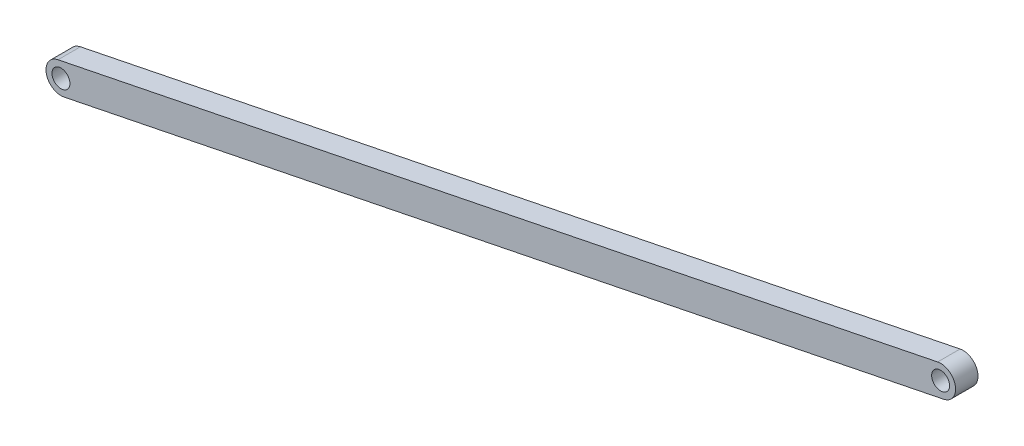
ISO-10303-21;
HEADER;
FILE_DESCRIPTION(('STEP AP214'),'2;1');
FILE_NAME('part.step','',(''),(''),'','','');
FILE_SCHEMA(('AUTOMOTIVE_DESIGN { 1 0 10303 214 1 1 1 1 }'));
ENDSEC;
DATA;
#1=APPLICATION_CONTEXT('core data for automotive mechanical design processes');
#2=APPLICATION_PROTOCOL_DEFINITION('international standard','automotive_design',2000,#1);
#3=PRODUCT_CONTEXT('',#1,'mechanical');
#4=PRODUCT('Part','Part','',(#3));
#5=PRODUCT_RELATED_PRODUCT_CATEGORY('part','',(#4));
#6=PRODUCT_DEFINITION_FORMATION('','',#4);
#7=PRODUCT_DEFINITION_CONTEXT('part definition',#1,'design');
#8=PRODUCT_DEFINITION('design','',#6,#7);
#9=PRODUCT_DEFINITION_SHAPE('','',#8);
#10=(LENGTH_UNIT() NAMED_UNIT(*) SI_UNIT(.MILLI.,.METRE.));
#11=(NAMED_UNIT(*) PLANE_ANGLE_UNIT() SI_UNIT($,.RADIAN.));
#12=(NAMED_UNIT(*) SI_UNIT($,.STERADIAN.) SOLID_ANGLE_UNIT());
#13=UNCERTAINTY_MEASURE_WITH_UNIT(LENGTH_MEASURE(1.E-05),#10,'distance_accuracy_value','');
#14=(GEOMETRIC_REPRESENTATION_CONTEXT(3) GLOBAL_UNCERTAINTY_ASSIGNED_CONTEXT((#13)) GLOBAL_UNIT_ASSIGNED_CONTEXT((#10,
#11,#12)) REPRESENTATION_CONTEXT('',''));
#15=CARTESIAN_POINT('',(0.,0.,0.));
#16=DIRECTION('',(0.,0.,1.));
#17=DIRECTION('',(1.,0.,0.));
#18=AXIS2_PLACEMENT_3D('',#15,#16,#17);
#19=CARTESIAN_POINT('',(0.,0.,30.));
#20=DIRECTION('',(0.,0.,1.));
#21=DIRECTION('',(1.,0.,0.));
#22=AXIS2_PLACEMENT_3D('',#19,#20,#21);
#23=PLANE('',#22);
#24=CARTESIAN_POINT('',(0.,0.,30.));
#25=DIRECTION('',(0.,0.,1.));
#26=DIRECTION('',(1.,0.,0.));
#27=AXIS2_PLACEMENT_3D('',#24,#25,#26);
#28=CIRCLE('',#27,12.);
#29=CARTESIAN_POINT('',(12.,0.,30.));
#30=VERTEX_POINT('',#29);
#31=EDGE_CURVE('E112',#30,#30,#28,.T.);
#32=ORIENTED_EDGE('',*,*,#31,.F.);
#33=EDGE_LOOP('',(#32));
#34=FACE_BOUND('',#33,.T.);
#35=CARTESIAN_POINT('',(0.,0.,30.));
#36=DIRECTION('',(0.,0.,1.));
#37=DIRECTION('',(1.,0.,0.));
#38=AXIS2_PLACEMENT_3D('',#35,#36,#37);
#39=CIRCLE('',#38,20.);
#40=CARTESIAN_POINT('',(-3.96903264333854,19.6022136473438,30.));
#41=VERTEX_POINT('',#40);
#42=CARTESIAN_POINT('',(3.96903264333854,-19.6022136473438,30.));
#43=VERTEX_POINT('',#42);
#44=EDGE_CURVE('E92',#41,#43,#39,.T.);
#45=ORIENTED_EDGE('',*,*,#44,.T.);
#46=DIRECTION('',(0.980110682367192,0.198451632166927,0.));
#47=VECTOR('',#46,1.);
#48=CARTESIAN_POINT('',(3.96903264333854,-19.6022136473438,30.));
#49=LINE('',#48,#47);
#50=CARTESIAN_POINT('',(1180.10185148397,218.539744952969,30.));
#51=VERTEX_POINT('',#50);
#52=EDGE_CURVE('E87',#43,#51,#49,.T.);
#53=ORIENTED_EDGE('',*,*,#52,.T.);
#54=CARTESIAN_POINT('',(1176.13281884063,238.141958600313,30.));
#55=DIRECTION('',(0.,0.,1.));
#56=DIRECTION('',(1.,0.,0.));
#57=AXIS2_PLACEMENT_3D('',#54,#55,#56);
#58=CIRCLE('',#57,20.);
#59=CARTESIAN_POINT('',(1172.16378619729,257.744172247656,30.));
#60=VERTEX_POINT('',#59);
#61=EDGE_CURVE('E90',#51,#60,#58,.T.);
#62=ORIENTED_EDGE('',*,*,#61,.T.);
#63=DIRECTION('',(-0.980110682367192,-0.198451632166927,0.));
#64=VECTOR('',#63,1.);
#65=CARTESIAN_POINT('',(-3.96903264333854,19.6022136473438,30.));
#66=LINE('',#65,#64);
#67=EDGE_CURVE('E57',#60,#41,#66,.T.);
#68=ORIENTED_EDGE('',*,*,#67,.T.);
#69=EDGE_LOOP('',(#45,#53,#62,#68));
#70=FACE_BOUND('',#69,.T.);
#71=CARTESIAN_POINT('',(1176.13281884063,238.141958600313,30.));
#72=DIRECTION('',(0.,0.,1.));
#73=DIRECTION('',(1.,0.,0.));
#74=AXIS2_PLACEMENT_3D('',#71,#72,#73);
#75=CIRCLE('',#74,12.);
#76=CARTESIAN_POINT('',(1188.13281884063,238.141958600313,30.));
#77=VERTEX_POINT('',#76);
#78=EDGE_CURVE('E134',#77,#77,#75,.T.);
#79=ORIENTED_EDGE('',*,*,#78,.F.);
#80=EDGE_LOOP('',(#79));
#81=FACE_BOUND('',#80,.T.);
#82=ADVANCED_FACE('F39',(#34,#70,#81),#23,.T.);
#83=CARTESIAN_POINT('',(0.,0.,0.));
#84=DIRECTION('',(0.,0.,1.));
#85=DIRECTION('',(1.,0.,0.));
#86=AXIS2_PLACEMENT_3D('',#83,#84,#85);
#87=PLANE('',#86);
#88=CARTESIAN_POINT('',(0.,0.,0.));
#89=DIRECTION('',(0.,0.,1.));
#90=DIRECTION('',(1.,0.,0.));
#91=AXIS2_PLACEMENT_3D('',#88,#89,#90);
#92=CIRCLE('',#91,20.);
#93=CARTESIAN_POINT('',(-3.96903264333854,19.6022136473438,0.));
#94=VERTEX_POINT('',#93);
#95=CARTESIAN_POINT('',(3.96903264333854,-19.6022136473438,0.));
#96=VERTEX_POINT('',#95);
#97=EDGE_CURVE('E108',#94,#96,#92,.T.);
#98=ORIENTED_EDGE('',*,*,#97,.F.);
#99=DIRECTION('',(-0.980110682367192,-0.198451632166927,0.));
#100=VECTOR('',#99,1.);
#101=CARTESIAN_POINT('',(-3.96903264333854,19.6022136473438,0.));
#102=LINE('',#101,#100);
#103=CARTESIAN_POINT('',(1172.16378619729,257.744172247656,0.));
#104=VERTEX_POINT('',#103);
#105=EDGE_CURVE('E80',#104,#94,#102,.T.);
#106=ORIENTED_EDGE('',*,*,#105,.F.);
#107=CARTESIAN_POINT('',(1176.13281884063,238.141958600313,0.));
#108=DIRECTION('',(0.,0.,1.));
#109=DIRECTION('',(1.,0.,0.));
#110=AXIS2_PLACEMENT_3D('',#107,#108,#109);
#111=CIRCLE('',#110,20.);
#112=CARTESIAN_POINT('',(1180.10185148397,218.539744952969,0.));
#113=VERTEX_POINT('',#112);
#114=EDGE_CURVE('E74',#113,#104,#111,.T.);
#115=ORIENTED_EDGE('',*,*,#114,.F.);
#116=DIRECTION('',(0.980110682367192,0.198451632166927,0.));
#117=VECTOR('',#116,1.);
#118=CARTESIAN_POINT('',(3.96903264333854,-19.6022136473438,0.));
#119=LINE('',#118,#117);
#120=EDGE_CURVE('E97',#96,#113,#119,.T.);
#121=ORIENTED_EDGE('',*,*,#120,.F.);
#122=EDGE_LOOP('',(#98,#106,#115,#121));
#123=FACE_BOUND('',#122,.T.);
#124=CARTESIAN_POINT('',(0.,0.,0.));
#125=DIRECTION('',(0.,0.,1.));
#126=DIRECTION('',(1.,0.,0.));
#127=AXIS2_PLACEMENT_3D('',#124,#125,#126);
#128=CIRCLE('',#127,12.);
#129=CARTESIAN_POINT('',(12.,0.,0.));
#130=VERTEX_POINT('',#129);
#131=EDGE_CURVE('E130',#130,#130,#128,.T.);
#132=ORIENTED_EDGE('',*,*,#131,.T.);
#133=EDGE_LOOP('',(#132));
#134=FACE_BOUND('',#133,.T.);
#135=CARTESIAN_POINT('',(1176.13281884063,238.141958600313,0.));
#136=DIRECTION('',(0.,0.,1.));
#137=DIRECTION('',(1.,0.,0.));
#138=AXIS2_PLACEMENT_3D('',#135,#136,#137);
#139=CIRCLE('',#138,12.);
#140=CARTESIAN_POINT('',(1188.13281884063,238.141958600313,0.));
#141=VERTEX_POINT('',#140);
#142=EDGE_CURVE('E138',#141,#141,#139,.T.);
#143=ORIENTED_EDGE('',*,*,#142,.T.);
#144=EDGE_LOOP('',(#143));
#145=FACE_BOUND('',#144,.T.);
#146=ADVANCED_FACE('F125',(#123,#134,#145),#87,.F.);
#147=CARTESIAN_POINT('',(0.,0.,30.));
#148=DIRECTION('',(0.,0.,-1.));
#149=DIRECTION('',(-1.,0.,0.));
#150=AXIS2_PLACEMENT_3D('',#147,#148,#149);
#151=CYLINDRICAL_SURFACE('',#150,20.);
#152=ORIENTED_EDGE('',*,*,#97,.T.);
#153=DIRECTION('',(0.,0.,-1.));
#154=VECTOR('',#153,1.);
#155=CARTESIAN_POINT('',(3.96903264333854,-19.6022136473438,30.));
#156=LINE('',#155,#154);
#157=EDGE_CURVE('E11',#43,#96,#156,.T.);
#158=ORIENTED_EDGE('',*,*,#157,.F.);
#159=ORIENTED_EDGE('',*,*,#44,.F.);
#160=DIRECTION('',(0.,0.,-1.));
#161=VECTOR('',#160,1.);
#162=CARTESIAN_POINT('',(-3.96903264333854,19.6022136473438,30.));
#163=LINE('',#162,#161);
#164=EDGE_CURVE('E104',#41,#94,#163,.T.);
#165=ORIENTED_EDGE('',*,*,#164,.T.);
#166=EDGE_LOOP('',(#152,#158,#159,#165));
#167=FACE_BOUND('',#166,.T.);
#168=ADVANCED_FACE('F41',(#167),#151,.T.);
#169=CARTESIAN_POINT('',(3.96903264333854,-19.6022136473438,30.));
#170=DIRECTION('',(-0.198451632166927,0.980110682367192,0.));
#171=DIRECTION('',(-0.980110682367192,-0.198451632166927,0.));
#172=AXIS2_PLACEMENT_3D('',#169,#170,#171);
#173=PLANE('',#172);
#174=ORIENTED_EDGE('',*,*,#120,.T.);
#175=DIRECTION('',(0.,0.,-1.));
#176=VECTOR('',#175,1.);
#177=CARTESIAN_POINT('',(1180.10185148397,218.539744952969,30.));
#178=LINE('',#177,#176);
#179=EDGE_CURVE('E49',#51,#113,#178,.T.);
#180=ORIENTED_EDGE('',*,*,#179,.F.);
#181=ORIENTED_EDGE('',*,*,#52,.F.);
#182=ORIENTED_EDGE('',*,*,#157,.T.);
#183=EDGE_LOOP('',(#174,#180,#181,#182));
#184=FACE_BOUND('',#183,.T.);
#185=ADVANCED_FACE('F96',(#184),#173,.F.);
#186=CARTESIAN_POINT('',(1176.13281884063,238.141958600313,30.));
#187=DIRECTION('',(0.,0.,-1.));
#188=DIRECTION('',(-1.,0.,0.));
#189=AXIS2_PLACEMENT_3D('',#186,#187,#188);
#190=CYLINDRICAL_SURFACE('',#189,20.);
#191=ORIENTED_EDGE('',*,*,#114,.T.);
#192=DIRECTION('',(0.,0.,-1.));
#193=VECTOR('',#192,1.);
#194=CARTESIAN_POINT('',(1172.16378619729,257.744172247656,30.));
#195=LINE('',#194,#193);
#196=EDGE_CURVE('E99',#60,#104,#195,.T.);
#197=ORIENTED_EDGE('',*,*,#196,.F.);
#198=ORIENTED_EDGE('',*,*,#61,.F.);
#199=ORIENTED_EDGE('',*,*,#179,.T.);
#200=EDGE_LOOP('',(#191,#197,#198,#199));
#201=FACE_BOUND('',#200,.T.);
#202=ADVANCED_FACE('F100',(#201),#190,.T.);
#203=CARTESIAN_POINT('',(-3.96903264333854,19.6022136473438,30.));
#204=DIRECTION('',(0.198451632166927,-0.980110682367192,0.));
#205=DIRECTION('',(0.980110682367192,0.198451632166927,0.));
#206=AXIS2_PLACEMENT_3D('',#203,#204,#205);
#207=PLANE('',#206);
#208=ORIENTED_EDGE('',*,*,#105,.T.);
#209=ORIENTED_EDGE('',*,*,#164,.F.);
#210=ORIENTED_EDGE('',*,*,#67,.F.);
#211=ORIENTED_EDGE('',*,*,#196,.T.);
#212=EDGE_LOOP('',(#208,#209,#210,#211));
#213=FACE_BOUND('',#212,.T.);
#214=ADVANCED_FACE('F122',(#213),#207,.F.);
#215=CARTESIAN_POINT('',(0.,0.,30.));
#216=DIRECTION('',(0.,0.,-1.));
#217=DIRECTION('',(-1.,0.,0.));
#218=AXIS2_PLACEMENT_3D('',#215,#216,#217);
#219=CYLINDRICAL_SURFACE('',#218,12.);
#220=ORIENTED_EDGE('',*,*,#31,.T.);
#221=EDGE_LOOP('',(#220));
#222=FACE_BOUND('',#221,.T.);
#223=ORIENTED_EDGE('',*,*,#131,.F.);
#224=EDGE_LOOP('',(#223));
#225=FACE_BOUND('',#224,.T.);
#226=ADVANCED_FACE('F157',(#222,#225),#219,.F.);
#227=CARTESIAN_POINT('',(1176.13281884063,238.141958600313,30.));
#228=DIRECTION('',(0.,0.,-1.));
#229=DIRECTION('',(-1.,0.,0.));
#230=AXIS2_PLACEMENT_3D('',#227,#228,#229);
#231=CYLINDRICAL_SURFACE('',#230,12.);
#232=ORIENTED_EDGE('',*,*,#78,.T.);
#233=EDGE_LOOP('',(#232));
#234=FACE_BOUND('',#233,.T.);
#235=ORIENTED_EDGE('',*,*,#142,.F.);
#236=EDGE_LOOP('',(#235));
#237=FACE_BOUND('',#236,.T.);
#238=ADVANCED_FACE('F146',(#234,#237),#231,.F.);
#239=CLOSED_SHELL('',(#82,#146,#168,#185,#202,#214,#226,#238));
#240=MANIFOLD_SOLID_BREP('B2',#239);
#241=ADVANCED_BREP_SHAPE_REPRESENTATION('',(#18,#240),#14);
#242=SHAPE_DEFINITION_REPRESENTATION(#9,#241);
ENDSEC;
END-ISO-10303-21;
